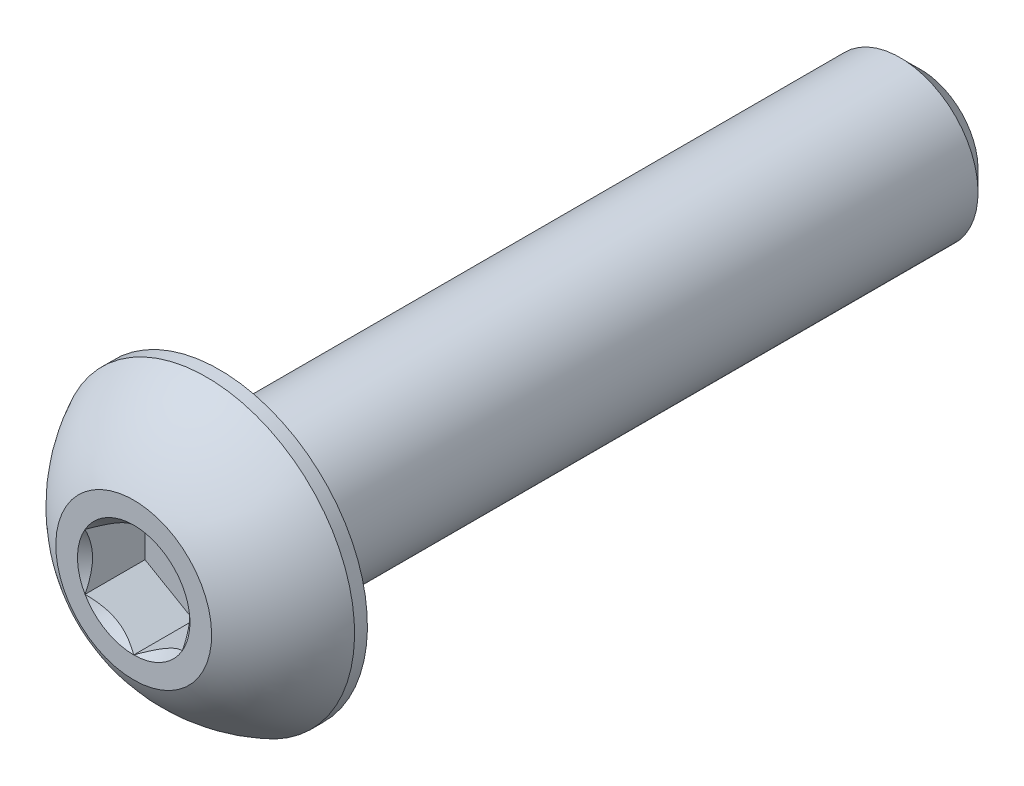
ISO-10303-21;
HEADER;
FILE_DESCRIPTION(('STEP AP214'),'2;1');
FILE_NAME('part.step','',(''),(''),'','','');
FILE_SCHEMA(('AUTOMOTIVE_DESIGN { 1 0 10303 214 1 1 1 1 }'));
ENDSEC;
DATA;
#1=APPLICATION_CONTEXT('core data for automotive mechanical design processes');
#2=APPLICATION_PROTOCOL_DEFINITION('international standard','automotive_design',2000,#1);
#3=PRODUCT_CONTEXT('',#1,'mechanical');
#4=PRODUCT('Part','Part','',(#3));
#5=PRODUCT_RELATED_PRODUCT_CATEGORY('part','',(#4));
#6=PRODUCT_DEFINITION_FORMATION('','',#4);
#7=PRODUCT_DEFINITION_CONTEXT('part definition',#1,'design');
#8=PRODUCT_DEFINITION('design','',#6,#7);
#9=PRODUCT_DEFINITION_SHAPE('','',#8);
#10=(LENGTH_UNIT() NAMED_UNIT(*) SI_UNIT(.MILLI.,.METRE.));
#11=(NAMED_UNIT(*) PLANE_ANGLE_UNIT() SI_UNIT($,.RADIAN.));
#12=(NAMED_UNIT(*) SI_UNIT($,.STERADIAN.) SOLID_ANGLE_UNIT());
#13=UNCERTAINTY_MEASURE_WITH_UNIT(LENGTH_MEASURE(1.E-05),#10,'distance_accuracy_value','');
#14=(GEOMETRIC_REPRESENTATION_CONTEXT(3) GLOBAL_UNCERTAINTY_ASSIGNED_CONTEXT((#13)) GLOBAL_UNIT_ASSIGNED_CONTEXT((#10,
#11,#12)) REPRESENTATION_CONTEXT('',''));
#15=CARTESIAN_POINT('',(0.,0.,0.));
#16=DIRECTION('',(0.,0.,1.));
#17=DIRECTION('',(1.,0.,0.));
#18=AXIS2_PLACEMENT_3D('',#15,#16,#17);
#19=CARTESIAN_POINT('',(0.,0.,-9.));
#20=DIRECTION('',(0.,0.,1.));
#21=DIRECTION('',(0.,-1.,0.));
#22=AXIS2_PLACEMENT_3D('',#19,#20,#21);
#23=PLANE('',#22);
#24=CARTESIAN_POINT('',(0.,0.,-9.));
#25=DIRECTION('',(0.,0.,1.));
#26=DIRECTION('',(0.,-1.,0.));
#27=AXIS2_PLACEMENT_3D('',#24,#25,#26);
#28=CIRCLE('',#27,1.47499999999999);
#29=CARTESIAN_POINT('',(0.,-1.47499999999999,-9.));
#30=VERTEX_POINT('',#29);
#31=EDGE_CURVE('E57',#30,#30,#28,.T.);
#32=ORIENTED_EDGE('',*,*,#31,.F.);
#33=EDGE_LOOP('',(#32));
#34=FACE_BOUND('',#33,.T.);
#35=ADVANCED_FACE('F43',(#34),#23,.F.);
#36=CARTESIAN_POINT('',(0.,0.,-9.));
#37=DIRECTION('',(0.,0.,1.));
#38=DIRECTION('',(0.,-1.,0.));
#39=AXIS2_PLACEMENT_3D('',#36,#37,#38);
#40=CONICAL_SURFACE('',#39,1.47499999999999,0.785398163397445);
#41=CARTESIAN_POINT('',(0.,0.,-8.475));
#42=DIRECTION('',(0.,0.,1.));
#43=DIRECTION('',(0.,-1.,0.));
#44=AXIS2_PLACEMENT_3D('',#41,#42,#43);
#45=CIRCLE('',#44,1.99999999999999);
#46=CARTESIAN_POINT('',(0.,-1.99999999999999,-8.475));
#47=VERTEX_POINT('',#46);
#48=EDGE_CURVE('E207',#47,#47,#45,.T.);
#49=ORIENTED_EDGE('',*,*,#48,.F.);
#50=EDGE_LOOP('',(#49));
#51=FACE_BOUND('',#50,.T.);
#52=ORIENTED_EDGE('',*,*,#31,.T.);
#53=EDGE_LOOP('',(#52));
#54=FACE_BOUND('',#53,.T.);
#55=ADVANCED_FACE('F214',(#51,#54),#40,.T.);
#56=CARTESIAN_POINT('',(0.,0.,11.2));
#57=DIRECTION('',(0.,0.,1.));
#58=DIRECTION('',(0.,-1.,0.));
#59=AXIS2_PLACEMENT_3D('',#56,#57,#58);
#60=CYLINDRICAL_SURFACE('',#59,1.99999999999999);
#61=CARTESIAN_POINT('',(0.,0.,9.));
#62=DIRECTION('',(0.,0.,1.));
#63=DIRECTION('',(0.,-1.,0.));
#64=AXIS2_PLACEMENT_3D('',#61,#62,#63);
#65=CIRCLE('',#64,2.);
#66=CARTESIAN_POINT('',(0.,-2.,9.));
#67=VERTEX_POINT('',#66);
#68=EDGE_CURVE('E203',#67,#67,#65,.T.);
#69=ORIENTED_EDGE('',*,*,#68,.F.);
#70=EDGE_LOOP('',(#69));
#71=FACE_BOUND('',#70,.T.);
#72=ORIENTED_EDGE('',*,*,#48,.T.);
#73=EDGE_LOOP('',(#72));
#74=FACE_BOUND('',#73,.T.);
#75=ADVANCED_FACE('F220',(#71,#74),#60,.T.);
#76=CARTESIAN_POINT('',(0.,-3.8,9.));
#77=DIRECTION('',(0.,0.,1.));
#78=DIRECTION('',(0.,-1.,0.));
#79=AXIS2_PLACEMENT_3D('',#76,#77,#78);
#80=PLANE('',#79);
#81=CARTESIAN_POINT('',(0.,0.,9.));
#82=DIRECTION('',(0.,0.,1.));
#83=DIRECTION('',(0.,-1.,0.));
#84=AXIS2_PLACEMENT_3D('',#81,#82,#83);
#85=CIRCLE('',#84,3.8);
#86=CARTESIAN_POINT('',(0.,-3.8,9.));
#87=VERTEX_POINT('',#86);
#88=EDGE_CURVE('E195',#87,#87,#85,.T.);
#89=ORIENTED_EDGE('',*,*,#88,.F.);
#90=EDGE_LOOP('',(#89));
#91=FACE_BOUND('',#90,.T.);
#92=ORIENTED_EDGE('',*,*,#68,.T.);
#93=EDGE_LOOP('',(#92));
#94=FACE_BOUND('',#93,.T.);
#95=ADVANCED_FACE('F225',(#91,#94),#80,.F.);
#96=CARTESIAN_POINT('',(0.,0.,7.47355614973262));
#97=DIRECTION('',(0.,0.,1.));
#98=DIRECTION('',(0.,-1.,0.));
#99=AXIS2_PLACEMENT_3D('',#96,#97,#98);
#100=SPHERICAL_SURFACE('',#99,4.22922968981297);
#101=CARTESIAN_POINT('',(0.,0.,11.2));
#102=DIRECTION('',(0.,0.,1.));
#103=DIRECTION('',(0.,-1.,0.));
#104=AXIS2_PLACEMENT_3D('',#101,#102,#103);
#105=CIRCLE('',#104,2.);
#106=CARTESIAN_POINT('',(0.,-2.,11.2));
#107=VERTEX_POINT('',#106);
#108=EDGE_CURVE('E199',#107,#107,#105,.T.);
#109=ORIENTED_EDGE('',*,*,#108,.F.);
#110=EDGE_LOOP('',(#109));
#111=FACE_BOUND('',#110,.T.);
#112=CARTESIAN_POINT('',(0.,0.,9.33));
#113=DIRECTION('',(0.,0.,1.));
#114=DIRECTION('',(0.,-1.,0.));
#115=AXIS2_PLACEMENT_3D('',#112,#113,#114);
#116=CIRCLE('',#115,3.8);
#117=CARTESIAN_POINT('',(0.,-3.8,9.33));
#118=VERTEX_POINT('',#117);
#119=EDGE_CURVE('E191',#118,#118,#116,.T.);
#120=ORIENTED_EDGE('',*,*,#119,.T.);
#121=EDGE_LOOP('',(#120));
#122=FACE_BOUND('',#121,.T.);
#123=ADVANCED_FACE('F230',(#111,#122),#100,.T.);
#124=CARTESIAN_POINT('',(0.,-2.,11.2));
#125=DIRECTION('',(0.,0.,-1.));
#126=DIRECTION('',(0.,1.,0.));
#127=AXIS2_PLACEMENT_3D('',#124,#125,#126);
#128=PLANE('',#127);
#129=CARTESIAN_POINT('',(0.,0.,11.2));
#130=DIRECTION('',(0.,0.,1.));
#131=DIRECTION('',(1.,0.,0.));
#132=AXIS2_PLACEMENT_3D('',#129,#130,#131);
#133=CIRCLE('',#132,1.44337567297406);
#134=CARTESIAN_POINT('',(0.,1.44337567297406,11.2));
#135=VERTEX_POINT('',#134);
#136=CARTESIAN_POINT('',(-1.25,0.721687836487029,11.2));
#137=VERTEX_POINT('',#136);
#138=EDGE_CURVE('E148',#135,#137,#133,.T.);
#139=ORIENTED_EDGE('',*,*,#138,.F.);
#140=CARTESIAN_POINT('',(1.25,0.721687836487031,11.2));
#141=VERTEX_POINT('',#140);
#142=EDGE_CURVE('E143',#141,#135,#133,.T.);
#143=ORIENTED_EDGE('',*,*,#142,.F.);
#144=CARTESIAN_POINT('',(1.25,-0.721687836487034,11.2));
#145=VERTEX_POINT('',#144);
#146=EDGE_CURVE('E111',#145,#141,#133,.T.);
#147=ORIENTED_EDGE('',*,*,#146,.F.);
#148=CARTESIAN_POINT('',(0.,-1.44337567297407,11.2));
#149=VERTEX_POINT('',#148);
#150=EDGE_CURVE('E102',#149,#145,#133,.T.);
#151=ORIENTED_EDGE('',*,*,#150,.F.);
#152=CARTESIAN_POINT('',(-1.25,-0.721687836487034,11.2));
#153=VERTEX_POINT('',#152);
#154=EDGE_CURVE('E63',#153,#149,#133,.T.);
#155=ORIENTED_EDGE('',*,*,#154,.F.);
#156=EDGE_CURVE('E70',#137,#153,#133,.T.);
#157=ORIENTED_EDGE('',*,*,#156,.F.);
#158=EDGE_LOOP('',(#139,#143,#147,#151,#155,#157));
#159=FACE_BOUND('',#158,.T.);
#160=ORIENTED_EDGE('',*,*,#108,.T.);
#161=EDGE_LOOP('',(#160));
#162=FACE_BOUND('',#161,.T.);
#163=ADVANCED_FACE('F140',(#159,#162),#128,.F.);
#164=CARTESIAN_POINT('',(0.,0.,11.2));
#165=DIRECTION('',(0.,0.,1.));
#166=DIRECTION('',(0.,-1.,0.));
#167=AXIS2_PLACEMENT_3D('',#164,#165,#166);
#168=CYLINDRICAL_SURFACE('',#167,3.8);
#169=ORIENTED_EDGE('',*,*,#119,.F.);
#170=EDGE_LOOP('',(#169));
#171=FACE_BOUND('',#170,.T.);
#172=ORIENTED_EDGE('',*,*,#88,.T.);
#173=EDGE_LOOP('',(#172));
#174=FACE_BOUND('',#173,.T.);
#175=ADVANCED_FACE('F236',(#171,#174),#168,.T.);
#176=CARTESIAN_POINT('',(0.,0.,11.2));
#177=DIRECTION('',(0.,0.,1.));
#178=DIRECTION('',(1.,0.,0.));
#179=AXIS2_PLACEMENT_3D('',#176,#177,#178);
#180=CONICAL_SURFACE('',#179,1.44337567297406,0.78539816339745);
#181=ORIENTED_EDGE('',*,*,#146,.T.);
#182=CARTESIAN_POINT('',(1.25,-1.43934010808077,11.6629820968923));
#183=CARTESIAN_POINT('',(1.25,-1.40429313005659,11.6365249226329));
#184=CARTESIAN_POINT('',(1.25,-1.36905087135599,11.6103271603543));
#185=CARTESIAN_POINT('',(1.25,-1.29809650706311,11.5585575718396));
#186=CARTESIAN_POINT('',(1.25,-1.26238428576496,11.5329859043563));
#187=CARTESIAN_POINT('',(1.25,-1.15390111792708,11.4570059936895));
#188=CARTESIAN_POINT('',(1.25,-1.08031646726265,11.4077402861896));
#189=CARTESIAN_POINT('',(1.25,-0.926012322755099,11.3110258302631));
#190=CARTESIAN_POINT('',(1.25,-0.84512531865615,11.2638412989418));
#191=CARTESIAN_POINT('',(1.25,-0.679311174076605,11.1775307343904));
#192=CARTESIAN_POINT('',(1.25,-0.59439889102669,11.1383775346269));
#193=CARTESIAN_POINT('',(1.25,-0.466944812460742,11.0904772236883));
#194=CARTESIAN_POINT('',(1.25,-0.426289985812823,11.0767294897863));
#195=CARTESIAN_POINT('',(1.25,-0.34399885009127,11.0524979274505));
#196=CARTESIAN_POINT('',(1.25,-0.302362473614964,11.0420143238698));
#197=CARTESIAN_POINT('',(1.25,-0.219052696285668,11.0250301617483));
#198=CARTESIAN_POINT('',(1.25,-0.177393428474502,11.0184613604714));
#199=CARTESIAN_POINT('',(1.25,-0.0936293693401942,11.0094350534578));
#200=CARTESIAN_POINT('',(1.25,-0.051524655854398,11.0069768409973));
#201=CARTESIAN_POINT('',(1.25,0.0311890576306297,11.0063540620133));
#202=CARTESIAN_POINT('',(1.25,0.0717969625499286,11.0080371168462));
#203=CARTESIAN_POINT('',(1.25,0.152668636885195,11.0152682705979));
#204=CARTESIAN_POINT('',(1.25,0.192932338835356,11.0208171104131));
#205=CARTESIAN_POINT('',(1.25,0.273499879165294,11.035571036465));
#206=CARTESIAN_POINT('',(1.25,0.31379218061851,11.0448381759641));
#207=CARTESIAN_POINT('',(1.25,0.393496413911456,11.0665361784573));
#208=CARTESIAN_POINT('',(1.25,0.432908419115058,11.0789667767306));
#209=CARTESIAN_POINT('',(1.25,0.556992735862297,11.1227793529314));
#210=CARTESIAN_POINT('',(1.25,0.639898924666085,11.159151072876));
#211=CARTESIAN_POINT('',(1.25,0.801816555499701,11.2400191621783));
#212=CARTESIAN_POINT('',(1.25,0.880812666325044,11.284544720912));
#213=CARTESIAN_POINT('',(1.25,1.0317856127975,11.3764048766666));
#214=CARTESIAN_POINT('',(1.25,1.10391618485086,11.4234899339162));
#215=CARTESIAN_POINT('',(1.25,1.2101860604331,11.4962785615985));
#216=CARTESIAN_POINT('',(1.25,1.24515069969379,11.5207980853934));
#217=CARTESIAN_POINT('',(1.25,1.31460220852736,11.5704856367657));
#218=CARTESIAN_POINT('',(1.25,1.34908920596618,11.5956534854155));
#219=CARTESIAN_POINT('',(1.25,1.38337731682912,11.6210901488412));
#220=B_SPLINE_CURVE_WITH_KNOTS('',3,(#182,#183,#184,#185,#186,#187,#188,#189,#190,#191,#192,
#193,#194,#195,#196,#197,#198,#199,#200,#201,#202,#203,#204,#205,#206,#207,#208,#209,#210,#211,
#212,#213,#214,#215,#216,#217,#218,#219),.UNSPECIFIED.,.F.,.F.,(4,2,2,2,2,2,2,2,2,2,2,2,2,2,2,2,
2,2,4),(0.,0.131732960381448,0.263498984161645,0.529042014455825,0.809741926134619,
1.08947609717225,1.21811634272577,1.34676544783901,1.47310084517844,1.59941451973785,
1.7211504216785,1.84290966131735,1.96679153905342,2.09066305366039,2.36146692896009,
2.63325989198492,2.8915466821228,3.01965734507713,3.14773302245628),.UNSPECIFIED.);
#221=EDGE_CURVE('E11',#145,#141,#220,.T.);
#222=ORIENTED_EDGE('',*,*,#221,.F.);
#223=EDGE_LOOP('',(#181,#222));
#224=FACE_BOUND('',#223,.T.);
#225=ADVANCED_FACE('F115',(#224),#180,.F.);
#226=ORIENTED_EDGE('',*,*,#142,.T.);
#227=CARTESIAN_POINT('',(1.2502,0.721572366433192,11.2001154839091));
#228=CARTESIAN_POINT('',(1.20722483292841,0.746384090710442,11.1753216680551));
#229=CARTESIAN_POINT('',(1.16353099525405,0.771610739653662,11.1519837344187));
#230=CARTESIAN_POINT('',(1.07443406915806,0.823050873919152,11.1092520040845));
#231=CARTESIAN_POINT('',(1.02902250164294,0.849269254648331,11.0898819923604));
#232=CARTESIAN_POINT('',(0.937452179064742,0.902137405038632,11.0567004834135));
#233=CARTESIAN_POINT('',(0.891316759824116,0.928773701756384,11.0428055590527));
#234=CARTESIAN_POINT('',(0.79802991959241,0.982632884076009,11.0213972821606));
#235=CARTESIAN_POINT('',(0.750881350863622,1.00985412292348,11.0138679415668));
#236=CARTESIAN_POINT('',(0.66962644311275,1.05676666578642,11.0070744980507));
#237=CARTESIAN_POINT('',(0.635625123372061,1.07639733689151,11.0060685591043));
#238=CARTESIAN_POINT('',(0.567682235567525,1.11562418145498,11.0077614149113));
#239=CARTESIAN_POINT('',(0.533740682344345,1.1352203463451,11.0104610272155));
#240=CARTESIAN_POINT('',(0.466185143542502,1.17422355485759,11.0194089303164));
#241=CARTESIAN_POINT('',(0.432571492713227,1.19363040521232,11.0256605258997));
#242=CARTESIAN_POINT('',(0.365905361782189,1.23212011385119,11.0413756814139));
#243=CARTESIAN_POINT('',(0.332853128969707,1.25120282936279,11.0508406200875));
#244=CARTESIAN_POINT('',(0.248200308399738,1.30007715810653,11.0789313906876));
#245=CARTESIAN_POINT('',(0.197133507570364,1.32956058931202,11.0996701574522));
#246=CARTESIAN_POINT('',(0.0969991458867461,1.38737318998519,11.1463871346715));
#247=CARTESIAN_POINT('',(0.0479256884217309,1.41570576386268,11.1723482959468));
#248=CARTESIAN_POINT('',(-0.000200000000000379,1.4434911430279,11.2001154839091));
#249=B_SPLINE_CURVE_WITH_KNOTS('',3,(#227,#228,#229,#230,#231,#232,#233,#234,#235,#236,#237,
#238,#239,#240,#241,#242,#243,#244,#245,#246,#247,#248),.UNSPECIFIED.,.F.,.F.,(4,2,2,2,2,2,2,2,
2,2,4),(0.,0.166533409618303,0.33403760728976,0.498880396489696,0.663307919240272,
0.780963963458824,0.89864597014845,1.01643764860773,1.13427993171549,1.32148652032141,
1.50809158792574),.UNSPECIFIED.);
#250=EDGE_CURVE('E147',#141,#135,#249,.T.);
#251=ORIENTED_EDGE('',*,*,#250,.F.);
#252=EDGE_LOOP('',(#226,#251));
#253=FACE_BOUND('',#252,.T.);
#254=ADVANCED_FACE('F323',(#253),#180,.F.);
#255=ORIENTED_EDGE('',*,*,#138,.T.);
#256=CARTESIAN_POINT('',(0.00019999999999969,1.4434911430279,11.2001154839091));
#257=CARTESIAN_POINT('',(-0.0427751670715863,1.41867941875065,11.1753216680551));
#258=CARTESIAN_POINT('',(-0.0864690047459474,1.39345276980743,11.1519837344187));
#259=CARTESIAN_POINT('',(-0.175565930841941,1.34201263554194,11.1092520040845));
#260=CARTESIAN_POINT('',(-0.220977498357063,1.31579425481276,11.0898819923604));
#261=CARTESIAN_POINT('',(-0.312547820935258,1.26292610442246,11.0567004834135));
#262=CARTESIAN_POINT('',(-0.358683240175884,1.23628980770471,11.0428055590527));
#263=CARTESIAN_POINT('',(-0.45197008040759,1.18243062538508,11.0213972821606));
#264=CARTESIAN_POINT('',(-0.499118649136378,1.15520938653761,11.0138679415668));
#265=CARTESIAN_POINT('',(-0.58037355688725,1.10829684367467,11.0070744980507));
#266=CARTESIAN_POINT('',(-0.614374876627939,1.08866617256958,11.0060685591043));
#267=CARTESIAN_POINT('',(-0.682317764432475,1.04943932800611,11.0077614149113));
#268=CARTESIAN_POINT('',(-0.716259317655656,1.02984316311599,11.0104610272155));
#269=CARTESIAN_POINT('',(-0.783814856457498,0.990839954603498,11.0194089303164));
#270=CARTESIAN_POINT('',(-0.817428507286773,0.97143310424877,11.0256605258997));
#271=CARTESIAN_POINT('',(-0.884094638217811,0.932943395609904,11.0413756814139));
#272=CARTESIAN_POINT('',(-0.917146871030293,0.913860680098299,11.0508406200875));
#273=CARTESIAN_POINT('',(-1.00179969160026,0.864986351354567,11.0789313906876));
#274=CARTESIAN_POINT('',(-1.05286649242964,0.835502920149075,11.0996701574522));
#275=CARTESIAN_POINT('',(-1.15300085411325,0.777690319475907,11.1463871346715));
#276=CARTESIAN_POINT('',(-1.20207431157827,0.749357745598415,11.1723482959468));
#277=CARTESIAN_POINT('',(-1.2502,0.721572366433192,11.2001154839091));
#278=B_SPLINE_CURVE_WITH_KNOTS('',3,(#256,#257,#258,#259,#260,#261,#262,#263,#264,#265,#266,
#267,#268,#269,#270,#271,#272,#273,#274,#275,#276,#277),.UNSPECIFIED.,.F.,.F.,(4,2,2,2,2,2,2,2,
2,2,4),(0.,0.166533409618302,0.33403760728976,0.498880396489696,0.663307919240272,
0.780963963458824,0.89864597014845,1.01643764860773,1.13427993171549,1.32148652032141,
1.50809158792574),.UNSPECIFIED.);
#279=EDGE_CURVE('E153',#135,#137,#278,.T.);
#280=ORIENTED_EDGE('',*,*,#279,.F.);
#281=EDGE_LOOP('',(#255,#280));
#282=FACE_BOUND('',#281,.T.);
#283=ADVANCED_FACE('F158',(#282),#180,.F.);
#284=ORIENTED_EDGE('',*,*,#156,.T.);
#285=CARTESIAN_POINT('',(-1.25,-1.43934010808078,11.6629820968923));
#286=CARTESIAN_POINT('',(-1.25,-1.40429313005659,11.6365249226329));
#287=CARTESIAN_POINT('',(-1.25,-1.36905087135599,11.6103271603543));
#288=CARTESIAN_POINT('',(-1.25,-1.29809650706311,11.5585575718396));
#289=CARTESIAN_POINT('',(-1.25,-1.26238428576496,11.5329859043563));
#290=CARTESIAN_POINT('',(-1.25,-1.15390111792708,11.4570059936895));
#291=CARTESIAN_POINT('',(-1.25,-1.08031646726265,11.4077402861896));
#292=CARTESIAN_POINT('',(-1.25,-0.926012322755099,11.3110258302631));
#293=CARTESIAN_POINT('',(-1.25,-0.84512531865615,11.2638412989418));
#294=CARTESIAN_POINT('',(-1.25,-0.679311174076605,11.1775307343904));
#295=CARTESIAN_POINT('',(-1.25,-0.59439889102669,11.1383775346269));
#296=CARTESIAN_POINT('',(-1.25,-0.466944812460742,11.0904772236883));
#297=CARTESIAN_POINT('',(-1.25,-0.426289985812824,11.0767294897863));
#298=CARTESIAN_POINT('',(-1.25,-0.34399885009127,11.0524979274505));
#299=CARTESIAN_POINT('',(-1.25,-0.302362473614964,11.0420143238698));
#300=CARTESIAN_POINT('',(-1.25,-0.219052696285667,11.0250301617483));
#301=CARTESIAN_POINT('',(-1.25,-0.177393428474502,11.0184613604714));
#302=CARTESIAN_POINT('',(-1.25,-0.0936293693401937,11.0094350534578));
#303=CARTESIAN_POINT('',(-1.25,-0.0515246558543974,11.0069768409973));
#304=CARTESIAN_POINT('',(-1.25,0.0311890576306303,11.0063540620133));
#305=CARTESIAN_POINT('',(-1.25,0.0717969625499292,11.0080371168462));
#306=CARTESIAN_POINT('',(-1.25,0.152668636885196,11.0152682705979));
#307=CARTESIAN_POINT('',(-1.25,0.192932338835357,11.0208171104131));
#308=CARTESIAN_POINT('',(-1.25,0.273499879165294,11.035571036465));
#309=CARTESIAN_POINT('',(-1.25,0.31379218061851,11.0448381759641));
#310=CARTESIAN_POINT('',(-1.25,0.393496413911456,11.0665361784573));
#311=CARTESIAN_POINT('',(-1.25,0.432908419115058,11.0789667767306));
#312=CARTESIAN_POINT('',(-1.25,0.556992735862297,11.1227793529314));
#313=CARTESIAN_POINT('',(-1.25,0.639898924666084,11.159151072876));
#314=CARTESIAN_POINT('',(-1.25,0.801816555499701,11.2400191621783));
#315=CARTESIAN_POINT('',(-1.25,0.880812666325044,11.284544720912));
#316=CARTESIAN_POINT('',(-1.25,1.0317856127975,11.3764048766666));
#317=CARTESIAN_POINT('',(-1.25,1.10391618485086,11.4234899339162));
#318=CARTESIAN_POINT('',(-1.25,1.2101860604331,11.4962785615985));
#319=CARTESIAN_POINT('',(-1.25,1.24515069969379,11.5207980853934));
#320=CARTESIAN_POINT('',(-1.25,1.31460220852736,11.5704856367657));
#321=CARTESIAN_POINT('',(-1.25,1.34908920596618,11.5956534854155));
#322=CARTESIAN_POINT('',(-1.25,1.38337731682911,11.6210901488412));
#323=B_SPLINE_CURVE_WITH_KNOTS('',3,(#285,#286,#287,#288,#289,#290,#291,#292,#293,#294,#295,
#296,#297,#298,#299,#300,#301,#302,#303,#304,#305,#306,#307,#308,#309,#310,#311,#312,#313,#314,
#315,#316,#317,#318,#319,#320,#321,#322),.UNSPECIFIED.,.F.,.F.,(4,2,2,2,2,2,2,2,2,2,2,2,2,2,2,2,
2,2,4),(0.,0.131732960381448,0.263498984161645,0.529042014455825,0.80974192613462,
1.08947609717225,1.21811634272577,1.34676544783901,1.47310084517844,1.59941451973785,
1.7211504216785,1.84290966131735,1.96679153905342,2.0906630536604,2.3614669289601,
2.63325989198492,2.8915466821228,3.01965734507713,3.14773302245628),.UNSPECIFIED.);
#324=EDGE_CURVE('E161',#137,#153,#323,.F.);
#325=ORIENTED_EDGE('',*,*,#324,.F.);
#326=EDGE_LOOP('',(#284,#325));
#327=FACE_BOUND('',#326,.T.);
#328=ADVANCED_FACE('F162',(#327),#180,.F.);
#329=ORIENTED_EDGE('',*,*,#154,.T.);
#330=CARTESIAN_POINT('',(-1.2502,-0.721572366433197,11.2001154839091));
#331=CARTESIAN_POINT('',(-1.20722483292841,-0.746384090710447,11.1753216680551));
#332=CARTESIAN_POINT('',(-1.16353099525405,-0.771610739653667,11.1519837344187));
#333=CARTESIAN_POINT('',(-1.07443406915806,-0.823050873919157,11.1092520040845));
#334=CARTESIAN_POINT('',(-1.02902250164294,-0.849269254648335,11.0898819923604));
#335=CARTESIAN_POINT('',(-0.93745217906474,-0.902137405038638,11.0567004834135));
#336=CARTESIAN_POINT('',(-0.891316759824114,-0.928773701756389,11.0428055590527));
#337=CARTESIAN_POINT('',(-0.798029919592408,-0.982632884076015,11.0213972821606));
#338=CARTESIAN_POINT('',(-0.750881350863621,-1.00985412292349,11.0138679415668));
#339=CARTESIAN_POINT('',(-0.669626443112749,-1.05676666578643,11.0070744980507));
#340=CARTESIAN_POINT('',(-0.63562512337206,-1.07639733689152,11.0060685591043));
#341=CARTESIAN_POINT('',(-0.567682235567523,-1.11562418145499,11.0077614149113));
#342=CARTESIAN_POINT('',(-0.533740682344343,-1.13522034634511,11.0104610272155));
#343=CARTESIAN_POINT('',(-0.466185143542501,-1.1742235548576,11.0194089303164));
#344=CARTESIAN_POINT('',(-0.432571492713226,-1.19363040521233,11.0256605258997));
#345=CARTESIAN_POINT('',(-0.365905361782188,-1.23212011385119,11.0413756814139));
#346=CARTESIAN_POINT('',(-0.332853128969705,-1.2512028293628,11.0508406200875));
#347=CARTESIAN_POINT('',(-0.248200308399736,-1.30007715810653,11.0789313906876));
#348=CARTESIAN_POINT('',(-0.197133507570362,-1.32956058931202,11.0996701574522));
#349=CARTESIAN_POINT('',(-0.0969991458867449,-1.38737318998519,11.1463871346715));
#350=CARTESIAN_POINT('',(-0.0479256884217299,-1.41570576386268,11.1723482959468));
#351=CARTESIAN_POINT('',(0.000200000000000518,-1.4434911430279,11.2001154839091));
#352=B_SPLINE_CURVE_WITH_KNOTS('',3,(#330,#331,#332,#333,#334,#335,#336,#337,#338,#339,#340,
#341,#342,#343,#344,#345,#346,#347,#348,#349,#350,#351),.UNSPECIFIED.,.F.,.F.,(4,2,2,2,2,2,2,2,
2,2,4),(0.,0.166533409618303,0.334037607289761,0.498880396489697,0.663307919240273,
0.780963963458825,0.898645970148451,1.01643764860773,1.13427993171549,1.32148652032141,
1.50809158792574),.UNSPECIFIED.);
#353=EDGE_CURVE('E128',#153,#149,#352,.T.);
#354=ORIENTED_EDGE('',*,*,#353,.F.);
#355=EDGE_LOOP('',(#329,#354));
#356=FACE_BOUND('',#355,.T.);
#357=ADVANCED_FACE('F264',(#356),#180,.F.);
#358=ORIENTED_EDGE('',*,*,#150,.T.);
#359=CARTESIAN_POINT('',(-0.000199999999999465,-1.4434911430279,11.2001154839091));
#360=CARTESIAN_POINT('',(0.0427751670715872,-1.41867941875066,11.1753216680551));
#361=CARTESIAN_POINT('',(0.0864690047459487,-1.39345276980743,11.1519837344187));
#362=CARTESIAN_POINT('',(0.175565930841942,-1.34201263554194,11.1092520040845));
#363=CARTESIAN_POINT('',(0.220977498357064,-1.31579425481277,11.0898819923604));
#364=CARTESIAN_POINT('',(0.312547820935259,-1.26292610442246,11.0567004834135));
#365=CARTESIAN_POINT('',(0.358683240175884,-1.23628980770471,11.0428055590527));
#366=CARTESIAN_POINT('',(0.451970080407591,-1.18243062538509,11.0213972821606));
#367=CARTESIAN_POINT('',(0.499118649136378,-1.15520938653762,11.0138679415668));
#368=CARTESIAN_POINT('',(0.580373556887251,-1.10829684367467,11.0070744980507));
#369=CARTESIAN_POINT('',(0.61437487662794,-1.08866617256958,11.0060685591043));
#370=CARTESIAN_POINT('',(0.682317764432476,-1.04943932800611,11.0077614149113));
#371=CARTESIAN_POINT('',(0.716259317655656,-1.029843163116,11.0104610272155));
#372=CARTESIAN_POINT('',(0.783814856457498,-0.990839954603502,11.0194089303164));
#373=CARTESIAN_POINT('',(0.817428507286774,-0.971433104248774,11.0256605258997));
#374=CARTESIAN_POINT('',(0.884094638217812,-0.932943395609908,11.0413756814139));
#375=CARTESIAN_POINT('',(0.917146871030294,-0.913860680098304,11.0508406200875));
#376=CARTESIAN_POINT('',(1.00179969160026,-0.864986351354571,11.0789313906876));
#377=CARTESIAN_POINT('',(1.05286649242964,-0.835502920149079,11.0996701574522));
#378=CARTESIAN_POINT('',(1.15300085411325,-0.777690319475911,11.1463871346715));
#379=CARTESIAN_POINT('',(1.20207431157827,-0.749357745598419,11.1723482959468));
#380=CARTESIAN_POINT('',(1.2502,-0.721572366433196,11.2001154839091));
#381=B_SPLINE_CURVE_WITH_KNOTS('',3,(#359,#360,#361,#362,#363,#364,#365,#366,#367,#368,#369,
#370,#371,#372,#373,#374,#375,#376,#377,#378,#379,#380),.UNSPECIFIED.,.F.,.F.,(4,2,2,2,2,2,2,2,
2,2,4),(0.,0.166533409618304,0.334037607289761,0.498880396489696,0.663307919240272,
0.780963963458825,0.898645970148451,1.01643764860773,1.13427993171549,1.32148652032141,
1.50809158792574),.UNSPECIFIED.);
#382=EDGE_CURVE('E106',#149,#145,#381,.T.);
#383=ORIENTED_EDGE('',*,*,#382,.F.);
#384=EDGE_LOOP('',(#358,#383));
#385=FACE_BOUND('',#384,.T.);
#386=ADVANCED_FACE('F104',(#385),#180,.F.);
#387=CARTESIAN_POINT('',(1.25,-0.721687836487034,9.66));
#388=DIRECTION('',(0.,0.,1.));
#389=DIRECTION('',(1.,0.,0.));
#390=AXIS2_PLACEMENT_3D('',#387,#388,#389);
#391=PLANE('',#390);
#392=DIRECTION('',(0.866025403784438,0.5,0.));
#393=VECTOR('',#392,1.);
#394=CARTESIAN_POINT('',(0.,-1.44337567297407,9.66));
#395=LINE('',#394,#393);
#396=CARTESIAN_POINT('',(0.,-1.44337567297407,9.66));
#397=VERTEX_POINT('',#396);
#398=CARTESIAN_POINT('',(1.25,-0.721687836487034,9.66));
#399=VERTEX_POINT('',#398);
#400=EDGE_CURVE('E127',#397,#399,#395,.T.);
#401=ORIENTED_EDGE('',*,*,#400,.T.);
#402=DIRECTION('',(0.,1.,0.));
#403=VECTOR('',#402,1.);
#404=CARTESIAN_POINT('',(1.25,-0.721687836487034,9.66));
#405=LINE('',#404,#403);
#406=CARTESIAN_POINT('',(1.25,0.72168783648703,9.66));
#407=VERTEX_POINT('',#406);
#408=EDGE_CURVE('E132',#399,#407,#405,.T.);
#409=ORIENTED_EDGE('',*,*,#408,.T.);
#410=DIRECTION('',(-0.866025403784439,0.5,0.));
#411=VECTOR('',#410,1.);
#412=CARTESIAN_POINT('',(1.25,0.72168783648703,9.66));
#413=LINE('',#412,#411);
#414=CARTESIAN_POINT('',(0.,1.44337567297406,9.66));
#415=VERTEX_POINT('',#414);
#416=EDGE_CURVE('E298',#407,#415,#413,.T.);
#417=ORIENTED_EDGE('',*,*,#416,.T.);
#418=DIRECTION('',(-0.866025403784438,-0.5,0.));
#419=VECTOR('',#418,1.);
#420=CARTESIAN_POINT('',(0.,1.44337567297406,9.66));
#421=LINE('',#420,#419);
#422=CARTESIAN_POINT('',(-1.25,0.72168783648703,9.66));
#423=VERTEX_POINT('',#422);
#424=EDGE_CURVE('E301',#415,#423,#421,.T.);
#425=ORIENTED_EDGE('',*,*,#424,.T.);
#426=DIRECTION('',(0.,-1.,0.));
#427=VECTOR('',#426,1.);
#428=CARTESIAN_POINT('',(-1.25,0.72168783648703,9.66));
#429=LINE('',#428,#427);
#430=CARTESIAN_POINT('',(-1.25,-0.721687836487034,9.66));
#431=VERTEX_POINT('',#430);
#432=EDGE_CURVE('E178',#423,#431,#429,.T.);
#433=ORIENTED_EDGE('',*,*,#432,.T.);
#434=DIRECTION('',(0.866025403784439,-0.5,0.));
#435=VECTOR('',#434,1.);
#436=CARTESIAN_POINT('',(-1.25,-0.721687836487034,9.66));
#437=LINE('',#436,#435);
#438=EDGE_CURVE('E136',#431,#397,#437,.T.);
#439=ORIENTED_EDGE('',*,*,#438,.T.);
#440=EDGE_LOOP('',(#401,#409,#417,#425,#433,#439));
#441=FACE_BOUND('',#440,.T.);
#442=ADVANCED_FACE('F263',(#441),#391,.T.);
#443=CARTESIAN_POINT('',(1.25,-0.721687836487034,9.66));
#444=DIRECTION('',(1.,0.,0.));
#445=DIRECTION('',(0.,0.,-1.));
#446=AXIS2_PLACEMENT_3D('',#443,#444,#445);
#447=PLANE('',#446);
#448=DIRECTION('',(0.,0.,1.));
#449=VECTOR('',#448,1.);
#450=CARTESIAN_POINT('',(1.25,-0.721687836487034,9.66));
#451=LINE('',#450,#449);
#452=EDGE_CURVE('E123',#399,#145,#451,.T.);
#453=ORIENTED_EDGE('',*,*,#452,.T.);
#454=ORIENTED_EDGE('',*,*,#221,.T.);
#455=DIRECTION('',(0.,0.,1.));
#456=VECTOR('',#455,1.);
#457=CARTESIAN_POINT('',(1.25,0.72168783648703,9.66));
#458=LINE('',#457,#456);
#459=EDGE_CURVE('E135',#407,#141,#458,.T.);
#460=ORIENTED_EDGE('',*,*,#459,.F.);
#461=ORIENTED_EDGE('',*,*,#408,.F.);
#462=EDGE_LOOP('',(#453,#454,#460,#461));
#463=FACE_BOUND('',#462,.T.);
#464=ADVANCED_FACE('F130',(#463),#447,.F.);
#465=CARTESIAN_POINT('',(1.25,0.72168783648703,9.66));
#466=DIRECTION('',(0.5,0.866025403784439,0.));
#467=DIRECTION('',(-0.866025403784439,0.5,0.));
#468=AXIS2_PLACEMENT_3D('',#465,#466,#467);
#469=PLANE('',#468);
#470=ORIENTED_EDGE('',*,*,#459,.T.);
#471=ORIENTED_EDGE('',*,*,#250,.T.);
#472=DIRECTION('',(0.,0.,1.));
#473=VECTOR('',#472,1.);
#474=CARTESIAN_POINT('',(0.,1.44337567297406,9.66));
#475=LINE('',#474,#473);
#476=EDGE_CURVE('E173',#415,#135,#475,.T.);
#477=ORIENTED_EDGE('',*,*,#476,.F.);
#478=ORIENTED_EDGE('',*,*,#416,.F.);
#479=EDGE_LOOP('',(#470,#471,#477,#478));
#480=FACE_BOUND('',#479,.T.);
#481=ADVANCED_FACE('F289',(#480),#469,.F.);
#482=CARTESIAN_POINT('',(0.,1.44337567297406,9.66));
#483=DIRECTION('',(-0.5,0.866025403784438,0.));
#484=DIRECTION('',(-0.866025403784439,-0.5,0.));
#485=AXIS2_PLACEMENT_3D('',#482,#483,#484);
#486=PLANE('',#485);
#487=ORIENTED_EDGE('',*,*,#476,.T.);
#488=ORIENTED_EDGE('',*,*,#279,.T.);
#489=DIRECTION('',(0.,0.,1.));
#490=VECTOR('',#489,1.);
#491=CARTESIAN_POINT('',(-1.25,0.72168783648703,9.66));
#492=LINE('',#491,#490);
#493=EDGE_CURVE('E171',#423,#137,#492,.T.);
#494=ORIENTED_EDGE('',*,*,#493,.F.);
#495=ORIENTED_EDGE('',*,*,#424,.F.);
#496=EDGE_LOOP('',(#487,#488,#494,#495));
#497=FACE_BOUND('',#496,.T.);
#498=ADVANCED_FACE('F169',(#497),#486,.F.);
#499=CARTESIAN_POINT('',(-1.25,0.72168783648703,9.66));
#500=DIRECTION('',(-1.,0.,0.));
#501=DIRECTION('',(0.,0.,1.));
#502=AXIS2_PLACEMENT_3D('',#499,#500,#501);
#503=PLANE('',#502);
#504=ORIENTED_EDGE('',*,*,#493,.T.);
#505=ORIENTED_EDGE('',*,*,#324,.T.);
#506=DIRECTION('',(0.,0.,1.));
#507=VECTOR('',#506,1.);
#508=CARTESIAN_POINT('',(-1.25,-0.721687836487034,9.66));
#509=LINE('',#508,#507);
#510=EDGE_CURVE('E181',#431,#153,#509,.T.);
#511=ORIENTED_EDGE('',*,*,#510,.F.);
#512=ORIENTED_EDGE('',*,*,#432,.F.);
#513=EDGE_LOOP('',(#504,#505,#511,#512));
#514=FACE_BOUND('',#513,.T.);
#515=ADVANCED_FACE('F176',(#514),#503,.F.);
#516=CARTESIAN_POINT('',(-1.25,-0.721687836487034,9.66));
#517=DIRECTION('',(-0.5,-0.866025403784439,0.));
#518=DIRECTION('',(0.866025403784439,-0.5,0.));
#519=AXIS2_PLACEMENT_3D('',#516,#517,#518);
#520=PLANE('',#519);
#521=ORIENTED_EDGE('',*,*,#510,.T.);
#522=ORIENTED_EDGE('',*,*,#353,.T.);
#523=DIRECTION('',(0.,0.,1.));
#524=VECTOR('',#523,1.);
#525=CARTESIAN_POINT('',(0.,-1.44337567297407,9.66));
#526=LINE('',#525,#524);
#527=EDGE_CURVE('E125',#397,#149,#526,.T.);
#528=ORIENTED_EDGE('',*,*,#527,.F.);
#529=ORIENTED_EDGE('',*,*,#438,.F.);
#530=EDGE_LOOP('',(#521,#522,#528,#529));
#531=FACE_BOUND('',#530,.T.);
#532=ADVANCED_FACE('F245',(#531),#520,.F.);
#533=CARTESIAN_POINT('',(0.,-1.44337567297407,9.66));
#534=DIRECTION('',(0.5,-0.866025403784438,0.));
#535=DIRECTION('',(0.866025403784439,0.5,0.));
#536=AXIS2_PLACEMENT_3D('',#533,#534,#535);
#537=PLANE('',#536);
#538=ORIENTED_EDGE('',*,*,#527,.T.);
#539=ORIENTED_EDGE('',*,*,#382,.T.);
#540=ORIENTED_EDGE('',*,*,#452,.F.);
#541=ORIENTED_EDGE('',*,*,#400,.F.);
#542=EDGE_LOOP('',(#538,#539,#540,#541));
#543=FACE_BOUND('',#542,.T.);
#544=ADVANCED_FACE('F121',(#543),#537,.F.);
#545=CLOSED_SHELL('',(#35,#55,#75,#95,#123,#163,#175,#225,#254,#283,#328,#357,#386,#442,#464,
#481,#498,#515,#532,#544));
#546=MANIFOLD_SOLID_BREP('B2',#545);
#547=ADVANCED_BREP_SHAPE_REPRESENTATION('',(#18,#546),#14);
#548=SHAPE_DEFINITION_REPRESENTATION(#9,#547);
ENDSEC;
END-ISO-10303-21;
